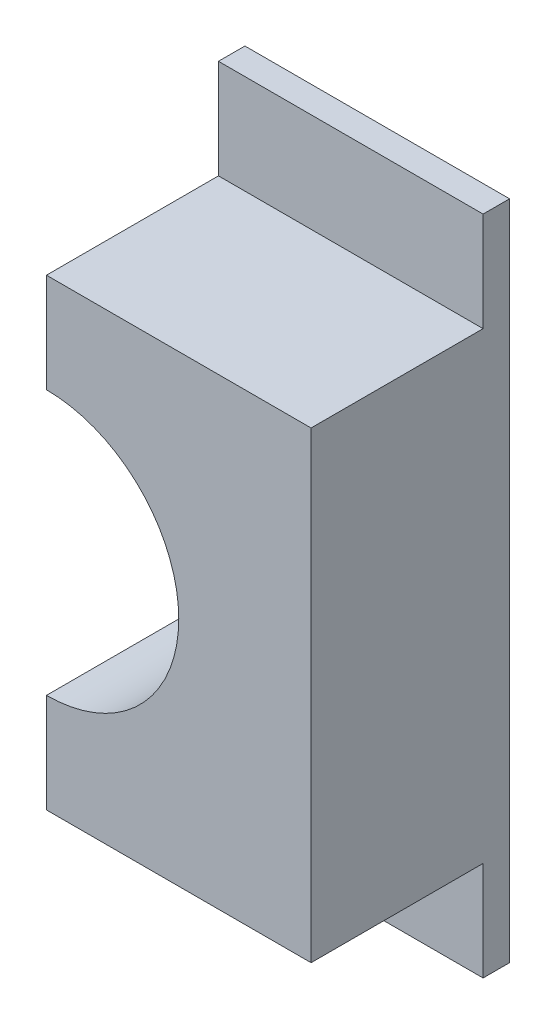
ISO-10303-21;
HEADER;
FILE_DESCRIPTION(('STEP AP214'),'2;1');
FILE_NAME('part.step','',(''),(''),'','','');
FILE_SCHEMA(('AUTOMOTIVE_DESIGN { 1 0 10303 214 1 1 1 1 }'));
ENDSEC;
DATA;
#1=APPLICATION_CONTEXT('core data for automotive mechanical design processes');
#2=APPLICATION_PROTOCOL_DEFINITION('international standard','automotive_design',2000,#1);
#3=PRODUCT_CONTEXT('',#1,'mechanical');
#4=PRODUCT('Part','Part','',(#3));
#5=PRODUCT_RELATED_PRODUCT_CATEGORY('part','',(#4));
#6=PRODUCT_DEFINITION_FORMATION('','',#4);
#7=PRODUCT_DEFINITION_CONTEXT('part definition',#1,'design');
#8=PRODUCT_DEFINITION('design','',#6,#7);
#9=PRODUCT_DEFINITION_SHAPE('','',#8);
#10=(LENGTH_UNIT() NAMED_UNIT(*) SI_UNIT(.MILLI.,.METRE.));
#11=(NAMED_UNIT(*) PLANE_ANGLE_UNIT() SI_UNIT($,.RADIAN.));
#12=(NAMED_UNIT(*) SI_UNIT($,.STERADIAN.) SOLID_ANGLE_UNIT());
#13=UNCERTAINTY_MEASURE_WITH_UNIT(LENGTH_MEASURE(1.E-05),#10,'distance_accuracy_value','');
#14=(GEOMETRIC_REPRESENTATION_CONTEXT(3) GLOBAL_UNCERTAINTY_ASSIGNED_CONTEXT((#13)) GLOBAL_UNIT_ASSIGNED_CONTEXT((#10,
#11,#12)) REPRESENTATION_CONTEXT('',''));
#15=CARTESIAN_POINT('',(0.,0.,0.));
#16=DIRECTION('',(0.,0.,1.));
#17=DIRECTION('',(1.,0.,0.));
#18=AXIS2_PLACEMENT_3D('',#15,#16,#17);
#19=CARTESIAN_POINT('',(-0.2,-0.5,0.04));
#20=DIRECTION('',(0.,0.,1.));
#21=DIRECTION('',(1.,0.,0.));
#22=AXIS2_PLACEMENT_3D('',#19,#20,#21);
#23=PLANE('',#22);
#24=DIRECTION('',(1.,0.,0.));
#25=VECTOR('',#24,1.);
#26=CARTESIAN_POINT('',(0.2,0.5,0.04));
#27=LINE('',#26,#25);
#28=CARTESIAN_POINT('',(0.2,0.5,0.04));
#29=VERTEX_POINT('',#28);
#30=CARTESIAN_POINT('',(-0.2,0.5,0.04));
#31=VERTEX_POINT('',#30);
#32=EDGE_CURVE('E156',#29,#31,#27,.F.);
#33=ORIENTED_EDGE('',*,*,#32,.T.);
#34=DIRECTION('',(0.,1.,0.));
#35=VECTOR('',#34,1.);
#36=CARTESIAN_POINT('',(-0.2,0.35,0.04));
#37=LINE('',#36,#35);
#38=CARTESIAN_POINT('',(-0.2,0.35,0.04));
#39=VERTEX_POINT('',#38);
#40=EDGE_CURVE('E146',#31,#39,#37,.F.);
#41=ORIENTED_EDGE('',*,*,#40,.T.);
#42=DIRECTION('',(1.,0.,0.));
#43=VECTOR('',#42,1.);
#44=CARTESIAN_POINT('',(0.2,0.35,0.04));
#45=LINE('',#44,#43);
#46=CARTESIAN_POINT('',(0.2,0.35,0.04));
#47=VERTEX_POINT('',#46);
#48=EDGE_CURVE('E80',#39,#47,#45,.T.);
#49=ORIENTED_EDGE('',*,*,#48,.T.);
#50=DIRECTION('',(0.,1.,0.));
#51=VECTOR('',#50,1.);
#52=CARTESIAN_POINT('',(0.2,-0.35,0.04));
#53=LINE('',#52,#51);
#54=EDGE_CURVE('E161',#47,#29,#53,.T.);
#55=ORIENTED_EDGE('',*,*,#54,.T.);
#56=EDGE_LOOP('',(#33,#41,#49,#55));
#57=FACE_BOUND('',#56,.T.);
#58=ADVANCED_FACE('F16',(#57),#23,.T.);
#59=CARTESIAN_POINT('',(0.2,0.35,0.3));
#60=DIRECTION('',(0.,-1.,0.));
#61=DIRECTION('',(0.,0.,-1.));
#62=AXIS2_PLACEMENT_3D('',#59,#60,#61);
#63=PLANE('',#62);
#64=ORIENTED_EDGE('',*,*,#48,.F.);
#65=DIRECTION('',(0.,0.,-1.));
#66=VECTOR('',#65,1.);
#67=CARTESIAN_POINT('',(-0.2,0.35,0.3));
#68=LINE('',#67,#66);
#69=CARTESIAN_POINT('',(-0.2,0.35,0.3));
#70=VERTEX_POINT('',#69);
#71=EDGE_CURVE('E138',#39,#70,#68,.F.);
#72=ORIENTED_EDGE('',*,*,#71,.T.);
#73=DIRECTION('',(1.,0.,0.));
#74=VECTOR('',#73,1.);
#75=CARTESIAN_POINT('',(-0.2,0.35,0.3));
#76=LINE('',#75,#74);
#77=CARTESIAN_POINT('',(0.2,0.35,0.3));
#78=VERTEX_POINT('',#77);
#79=EDGE_CURVE('E56',#78,#70,#76,.F.);
#80=ORIENTED_EDGE('',*,*,#79,.F.);
#81=DIRECTION('',(0.,0.,1.));
#82=VECTOR('',#81,1.);
#83=CARTESIAN_POINT('',(0.2,0.35,0.3));
#84=LINE('',#83,#82);
#85=EDGE_CURVE('E163',#78,#47,#84,.F.);
#86=ORIENTED_EDGE('',*,*,#85,.T.);
#87=EDGE_LOOP('',(#64,#72,#80,#86));
#88=FACE_BOUND('',#87,.T.);
#89=ADVANCED_FACE('F245',(#88),#63,.F.);
#90=CARTESIAN_POINT('',(-0.2,-0.35,0.3));
#91=DIRECTION('',(0.,1.,0.));
#92=DIRECTION('',(0.,0.,1.));
#93=AXIS2_PLACEMENT_3D('',#90,#91,#92);
#94=PLANE('',#93);
#95=DIRECTION('',(1.,0.,0.));
#96=VECTOR('',#95,1.);
#97=CARTESIAN_POINT('',(-0.2,-0.35,0.04));
#98=LINE('',#97,#96);
#99=CARTESIAN_POINT('',(0.2,-0.35,0.04));
#100=VERTEX_POINT('',#99);
#101=CARTESIAN_POINT('',(-0.2,-0.35,0.04));
#102=VERTEX_POINT('',#101);
#103=EDGE_CURVE('E123',#100,#102,#98,.F.);
#104=ORIENTED_EDGE('',*,*,#103,.F.);
#105=DIRECTION('',(0.,0.,1.));
#106=VECTOR('',#105,1.);
#107=CARTESIAN_POINT('',(0.2,-0.35,0.3));
#108=LINE('',#107,#106);
#109=CARTESIAN_POINT('',(0.2,-0.35,0.3));
#110=VERTEX_POINT('',#109);
#111=EDGE_CURVE('E168',#100,#110,#108,.T.);
#112=ORIENTED_EDGE('',*,*,#111,.T.);
#113=DIRECTION('',(1.,0.,0.));
#114=VECTOR('',#113,1.);
#115=CARTESIAN_POINT('',(-0.2,-0.35,0.3));
#116=LINE('',#115,#114);
#117=CARTESIAN_POINT('',(-0.2,-0.35,0.3));
#118=VERTEX_POINT('',#117);
#119=EDGE_CURVE('E133',#118,#110,#116,.T.);
#120=ORIENTED_EDGE('',*,*,#119,.F.);
#121=DIRECTION('',(0.,0.,-1.));
#122=VECTOR('',#121,1.);
#123=CARTESIAN_POINT('',(-0.2,-0.35,0.3));
#124=LINE('',#123,#122);
#125=EDGE_CURVE('E124',#118,#102,#124,.T.);
#126=ORIENTED_EDGE('',*,*,#125,.T.);
#127=EDGE_LOOP('',(#104,#112,#120,#126));
#128=FACE_BOUND('',#127,.T.);
#129=ADVANCED_FACE('F239',(#128),#94,.F.);
#130=CARTESIAN_POINT('',(-0.2,-0.5,0.04));
#131=DIRECTION('',(0.,0.,1.));
#132=DIRECTION('',(1.,0.,0.));
#133=AXIS2_PLACEMENT_3D('',#130,#131,#132);
#134=PLANE('',#133);
#135=DIRECTION('',(1.,0.,0.));
#136=VECTOR('',#135,1.);
#137=CARTESIAN_POINT('',(-0.2,-0.5,0.04));
#138=LINE('',#137,#136);
#139=CARTESIAN_POINT('',(-0.2,-0.5,0.04));
#140=VERTEX_POINT('',#139);
#141=CARTESIAN_POINT('',(0.2,-0.5,0.04));
#142=VERTEX_POINT('',#141);
#143=EDGE_CURVE('E87',#140,#142,#138,.T.);
#144=ORIENTED_EDGE('',*,*,#143,.T.);
#145=DIRECTION('',(0.,1.,0.));
#146=VECTOR('',#145,1.);
#147=CARTESIAN_POINT('',(0.2,-0.35,0.04));
#148=LINE('',#147,#146);
#149=EDGE_CURVE('E166',#142,#100,#148,.T.);
#150=ORIENTED_EDGE('',*,*,#149,.T.);
#151=ORIENTED_EDGE('',*,*,#103,.T.);
#152=DIRECTION('',(0.,1.,0.));
#153=VECTOR('',#152,1.);
#154=CARTESIAN_POINT('',(-0.2,0.35,0.04));
#155=LINE('',#154,#153);
#156=EDGE_CURVE('E119',#102,#140,#155,.F.);
#157=ORIENTED_EDGE('',*,*,#156,.T.);
#158=EDGE_LOOP('',(#144,#150,#151,#157));
#159=FACE_BOUND('',#158,.T.);
#160=ADVANCED_FACE('F122',(#159),#134,.T.);
#161=CARTESIAN_POINT('',(-0.2,-0.35,0.3));
#162=DIRECTION('',(0.,0.,1.));
#163=DIRECTION('',(1.,0.,0.));
#164=AXIS2_PLACEMENT_3D('',#161,#162,#163);
#165=PLANE('',#164);
#166=ORIENTED_EDGE('',*,*,#79,.T.);
#167=DIRECTION('',(0.,1.,0.));
#168=VECTOR('',#167,1.);
#169=CARTESIAN_POINT('',(-0.2,0.35,0.3));
#170=LINE('',#169,#168);
#171=CARTESIAN_POINT('',(-0.2,0.2,0.3));
#172=VERTEX_POINT('',#171);
#173=EDGE_CURVE('E47',#70,#172,#170,.F.);
#174=ORIENTED_EDGE('',*,*,#173,.T.);
#175=CARTESIAN_POINT('',(-0.2,0.,0.3));
#176=DIRECTION('',(0.,0.,1.));
#177=DIRECTION('',(1.,0.,0.));
#178=AXIS2_PLACEMENT_3D('',#175,#176,#177);
#179=CIRCLE('',#178,0.2);
#180=CARTESIAN_POINT('',(-0.2,-0.2,0.3));
#181=VERTEX_POINT('',#180);
#182=EDGE_CURVE('E19',#172,#181,#179,.F.);
#183=ORIENTED_EDGE('',*,*,#182,.T.);
#184=DIRECTION('',(0.,1.,0.));
#185=VECTOR('',#184,1.);
#186=CARTESIAN_POINT('',(-0.2,0.35,0.3));
#187=LINE('',#186,#185);
#188=EDGE_CURVE('E199',#181,#118,#187,.F.);
#189=ORIENTED_EDGE('',*,*,#188,.T.);
#190=ORIENTED_EDGE('',*,*,#119,.T.);
#191=DIRECTION('',(0.,1.,0.));
#192=VECTOR('',#191,1.);
#193=CARTESIAN_POINT('',(0.2,-0.35,0.3));
#194=LINE('',#193,#192);
#195=EDGE_CURVE('E115',#110,#78,#194,.T.);
#196=ORIENTED_EDGE('',*,*,#195,.T.);
#197=EDGE_LOOP('',(#166,#174,#183,#189,#190,#196));
#198=FACE_BOUND('',#197,.T.);
#199=ADVANCED_FACE('F233',(#198),#165,.T.);
#200=CARTESIAN_POINT('',(-0.2,-0.5,0.04));
#201=DIRECTION('',(0.,1.,0.));
#202=DIRECTION('',(0.,0.,1.));
#203=AXIS2_PLACEMENT_3D('',#200,#201,#202);
#204=PLANE('',#203);
#205=DIRECTION('',(0.,0.,1.));
#206=VECTOR('',#205,1.);
#207=CARTESIAN_POINT('',(0.2,-0.5,0.3));
#208=LINE('',#207,#206);
#209=CARTESIAN_POINT('',(0.2,-0.5,0.));
#210=VERTEX_POINT('',#209);
#211=EDGE_CURVE('E114',#210,#142,#208,.T.);
#212=ORIENTED_EDGE('',*,*,#211,.T.);
#213=ORIENTED_EDGE('',*,*,#143,.F.);
#214=DIRECTION('',(0.,0.,-1.));
#215=VECTOR('',#214,1.);
#216=CARTESIAN_POINT('',(-0.2,-0.5,0.3));
#217=LINE('',#216,#215);
#218=CARTESIAN_POINT('',(-0.2,-0.5,0.));
#219=VERTEX_POINT('',#218);
#220=EDGE_CURVE('E113',#140,#219,#217,.T.);
#221=ORIENTED_EDGE('',*,*,#220,.T.);
#222=DIRECTION('',(1.,0.,0.));
#223=VECTOR('',#222,1.);
#224=CARTESIAN_POINT('',(-0.2,-0.5,0.));
#225=LINE('',#224,#223);
#226=EDGE_CURVE('E106',#219,#210,#225,.T.);
#227=ORIENTED_EDGE('',*,*,#226,.T.);
#228=EDGE_LOOP('',(#212,#213,#221,#227));
#229=FACE_BOUND('',#228,.T.);
#230=ADVANCED_FACE('F112',(#229),#204,.F.);
#231=CARTESIAN_POINT('',(0.2,-0.35,0.3));
#232=DIRECTION('',(-1.,0.,0.));
#233=DIRECTION('',(0.,0.,1.));
#234=AXIS2_PLACEMENT_3D('',#231,#232,#233);
#235=PLANE('',#234);
#236=ORIENTED_EDGE('',*,*,#149,.F.);
#237=ORIENTED_EDGE('',*,*,#211,.F.);
#238=DIRECTION('',(0.,1.,0.));
#239=VECTOR('',#238,1.);
#240=CARTESIAN_POINT('',(0.2,-0.35,0.));
#241=LINE('',#240,#239);
#242=CARTESIAN_POINT('',(0.2,0.5,0.));
#243=VERTEX_POINT('',#242);
#244=EDGE_CURVE('E192',#210,#243,#241,.T.);
#245=ORIENTED_EDGE('',*,*,#244,.T.);
#246=DIRECTION('',(0.,0.,-1.));
#247=VECTOR('',#246,1.);
#248=CARTESIAN_POINT('',(0.2,0.5,0.04));
#249=LINE('',#248,#247);
#250=EDGE_CURVE('E158',#243,#29,#249,.F.);
#251=ORIENTED_EDGE('',*,*,#250,.T.);
#252=ORIENTED_EDGE('',*,*,#54,.F.);
#253=ORIENTED_EDGE('',*,*,#85,.F.);
#254=ORIENTED_EDGE('',*,*,#195,.F.);
#255=ORIENTED_EDGE('',*,*,#111,.F.);
#256=EDGE_LOOP('',(#236,#237,#245,#251,#252,#253,#254,#255));
#257=FACE_BOUND('',#256,.T.);
#258=ADVANCED_FACE('F238',(#257),#235,.F.);
#259=CARTESIAN_POINT('',(0.2,0.5,0.04));
#260=DIRECTION('',(0.,-1.,0.));
#261=DIRECTION('',(0.,0.,-1.));
#262=AXIS2_PLACEMENT_3D('',#259,#260,#261);
#263=PLANE('',#262);
#264=DIRECTION('',(0.,0.,-1.));
#265=VECTOR('',#264,1.);
#266=CARTESIAN_POINT('',(-0.2,0.5,0.3));
#267=LINE('',#266,#265);
#268=CARTESIAN_POINT('',(-0.2,0.5,0.));
#269=VERTEX_POINT('',#268);
#270=EDGE_CURVE('E153',#269,#31,#267,.F.);
#271=ORIENTED_EDGE('',*,*,#270,.T.);
#272=ORIENTED_EDGE('',*,*,#32,.F.);
#273=ORIENTED_EDGE('',*,*,#250,.F.);
#274=DIRECTION('',(1.,0.,0.));
#275=VECTOR('',#274,1.);
#276=CARTESIAN_POINT('',(-0.2,0.5,0.));
#277=LINE('',#276,#275);
#278=EDGE_CURVE('E186',#243,#269,#277,.F.);
#279=ORIENTED_EDGE('',*,*,#278,.T.);
#280=EDGE_LOOP('',(#271,#272,#273,#279));
#281=FACE_BOUND('',#280,.T.);
#282=ADVANCED_FACE('F265',(#281),#263,.F.);
#283=CARTESIAN_POINT('',(-0.2,0.35,0.3));
#284=DIRECTION('',(1.,0.,0.));
#285=DIRECTION('',(0.,0.,-1.));
#286=AXIS2_PLACEMENT_3D('',#283,#284,#285);
#287=PLANE('',#286);
#288=DIRECTION('',(0.,0.,1.));
#289=VECTOR('',#288,1.);
#290=CARTESIAN_POINT('',(-0.2,0.2,1.20415945787923));
#291=LINE('',#290,#289);
#292=CARTESIAN_POINT('',(-0.2,0.2,0.));
#293=VERTEX_POINT('',#292);
#294=EDGE_CURVE('E137',#293,#172,#291,.T.);
#295=ORIENTED_EDGE('',*,*,#294,.T.);
#296=ORIENTED_EDGE('',*,*,#173,.F.);
#297=ORIENTED_EDGE('',*,*,#71,.F.);
#298=ORIENTED_EDGE('',*,*,#40,.F.);
#299=ORIENTED_EDGE('',*,*,#270,.F.);
#300=DIRECTION('',(0.,1.,0.));
#301=VECTOR('',#300,1.);
#302=CARTESIAN_POINT('',(-0.2,-0.35,0.));
#303=LINE('',#302,#301);
#304=EDGE_CURVE('E182',#269,#293,#303,.F.);
#305=ORIENTED_EDGE('',*,*,#304,.T.);
#306=EDGE_LOOP('',(#295,#296,#297,#298,#299,#305));
#307=FACE_BOUND('',#306,.T.);
#308=ADVANCED_FACE('F241',(#307),#287,.F.);
#309=CARTESIAN_POINT('',(-0.2,0.,1.20415945787923));
#310=DIRECTION('',(0.,0.,1.));
#311=DIRECTION('',(1.,0.,0.));
#312=AXIS2_PLACEMENT_3D('',#309,#310,#311);
#313=CYLINDRICAL_SURFACE('',#312,0.2);
#314=ORIENTED_EDGE('',*,*,#294,.F.);
#315=CARTESIAN_POINT('',(-0.2,0.,0.));
#316=DIRECTION('',(0.,0.,1.));
#317=DIRECTION('',(1.,0.,0.));
#318=AXIS2_PLACEMENT_3D('',#315,#316,#317);
#319=CIRCLE('',#318,0.2);
#320=CARTESIAN_POINT('',(-0.2,-0.2,0.));
#321=VERTEX_POINT('',#320);
#322=EDGE_CURVE('E25',#293,#321,#319,.F.);
#323=ORIENTED_EDGE('',*,*,#322,.T.);
#324=DIRECTION('',(0.,0.,-1.));
#325=VECTOR('',#324,1.);
#326=CARTESIAN_POINT('',(-0.2,-0.2,0.3));
#327=LINE('',#326,#325);
#328=EDGE_CURVE('E33',#321,#181,#327,.F.);
#329=ORIENTED_EDGE('',*,*,#328,.T.);
#330=ORIENTED_EDGE('',*,*,#182,.F.);
#331=EDGE_LOOP('',(#314,#323,#329,#330));
#332=FACE_BOUND('',#331,.T.);
#333=ADVANCED_FACE('F240',(#332),#313,.F.);
#334=CARTESIAN_POINT('',(-0.2,0.35,0.3));
#335=DIRECTION('',(1.,0.,0.));
#336=DIRECTION('',(0.,0.,-1.));
#337=AXIS2_PLACEMENT_3D('',#334,#335,#336);
#338=PLANE('',#337);
#339=ORIENTED_EDGE('',*,*,#328,.F.);
#340=DIRECTION('',(0.,1.,0.));
#341=VECTOR('',#340,1.);
#342=CARTESIAN_POINT('',(-0.2,-0.35,0.));
#343=LINE('',#342,#341);
#344=EDGE_CURVE('E11',#321,#219,#343,.F.);
#345=ORIENTED_EDGE('',*,*,#344,.T.);
#346=ORIENTED_EDGE('',*,*,#220,.F.);
#347=ORIENTED_EDGE('',*,*,#156,.F.);
#348=ORIENTED_EDGE('',*,*,#125,.F.);
#349=ORIENTED_EDGE('',*,*,#188,.F.);
#350=EDGE_LOOP('',(#339,#345,#346,#347,#348,#349));
#351=FACE_BOUND('',#350,.T.);
#352=ADVANCED_FACE('F118',(#351),#338,.F.);
#353=CARTESIAN_POINT('',(-0.2,-0.35,0.));
#354=DIRECTION('',(0.,0.,1.));
#355=DIRECTION('',(1.,0.,0.));
#356=AXIS2_PLACEMENT_3D('',#353,#354,#355);
#357=PLANE('',#356);
#358=ORIENTED_EDGE('',*,*,#322,.F.);
#359=ORIENTED_EDGE('',*,*,#304,.F.);
#360=ORIENTED_EDGE('',*,*,#278,.F.);
#361=ORIENTED_EDGE('',*,*,#244,.F.);
#362=ORIENTED_EDGE('',*,*,#226,.F.);
#363=ORIENTED_EDGE('',*,*,#344,.F.);
#364=EDGE_LOOP('',(#358,#359,#360,#361,#362,#363));
#365=FACE_BOUND('',#364,.T.);
#366=ADVANCED_FACE('F253',(#365),#357,.F.);
#367=CLOSED_SHELL('',(#58,#89,#129,#160,#199,#230,#258,#282,#308,#333,#352,#366));
#368=MANIFOLD_SOLID_BREP('B1',#367);
#369=ADVANCED_BREP_SHAPE_REPRESENTATION('',(#18,#368),#14);
#370=SHAPE_DEFINITION_REPRESENTATION(#9,#369);
ENDSEC;
END-ISO-10303-21;
